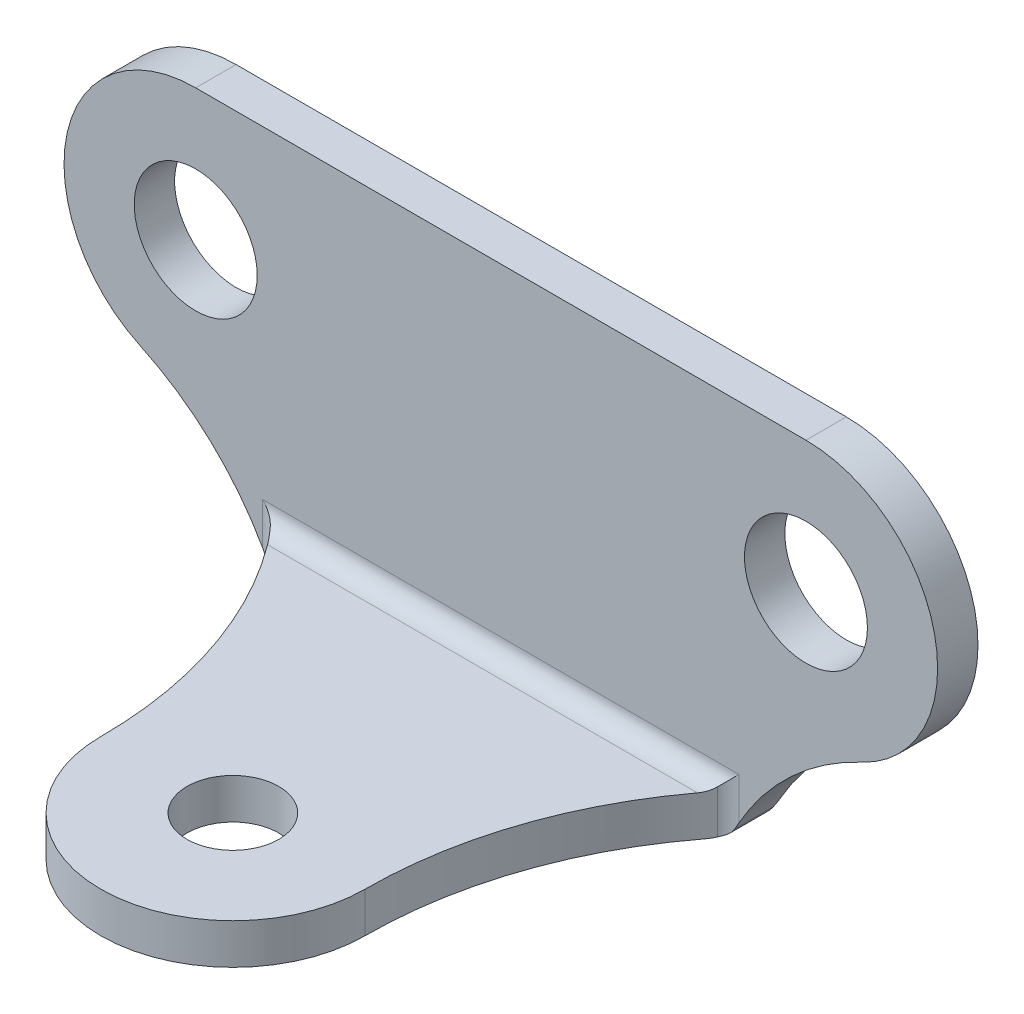
ISO-10303-21;
HEADER;
FILE_DESCRIPTION(('STEP AP214'),'2;1');
FILE_NAME('part.step','',(''),(''),'','','');
FILE_SCHEMA(('AUTOMOTIVE_DESIGN { 1 0 10303 214 1 1 1 1 }'));
ENDSEC;
DATA;
#1=APPLICATION_CONTEXT('core data for automotive mechanical design processes');
#2=APPLICATION_PROTOCOL_DEFINITION('international standard','automotive_design',2000,#1);
#3=PRODUCT_CONTEXT('',#1,'mechanical');
#4=PRODUCT('Part','Part','',(#3));
#5=PRODUCT_RELATED_PRODUCT_CATEGORY('part','',(#4));
#6=PRODUCT_DEFINITION_FORMATION('','',#4);
#7=PRODUCT_DEFINITION_CONTEXT('part definition',#1,'design');
#8=PRODUCT_DEFINITION('design','',#6,#7);
#9=PRODUCT_DEFINITION_SHAPE('','',#8);
#10=(LENGTH_UNIT() NAMED_UNIT(*) SI_UNIT(.MILLI.,.METRE.));
#11=(NAMED_UNIT(*) PLANE_ANGLE_UNIT() SI_UNIT($,.RADIAN.));
#12=(NAMED_UNIT(*) SI_UNIT($,.STERADIAN.) SOLID_ANGLE_UNIT());
#13=UNCERTAINTY_MEASURE_WITH_UNIT(LENGTH_MEASURE(1.E-05),#10,'distance_accuracy_value','');
#14=(GEOMETRIC_REPRESENTATION_CONTEXT(3) GLOBAL_UNCERTAINTY_ASSIGNED_CONTEXT((#13)) GLOBAL_UNIT_ASSIGNED_CONTEXT((#10,
#11,#12)) REPRESENTATION_CONTEXT('',''));
#15=CARTESIAN_POINT('',(0.,0.,0.));
#16=DIRECTION('',(0.,0.,1.));
#17=DIRECTION('',(1.,0.,0.));
#18=AXIS2_PLACEMENT_3D('',#15,#16,#17);
#19=CARTESIAN_POINT('',(0.,-13.625,2.2));
#20=DIRECTION('',(0.,1.,0.));
#21=DIRECTION('',(0.,0.,1.));
#22=AXIS2_PLACEMENT_3D('',#19,#20,#21);
#23=PLANE('',#22);
#24=DIRECTION('',(1.,0.,0.));
#25=VECTOR('',#24,1.);
#26=CARTESIAN_POINT('',(0.,-13.625,1.));
#27=LINE('',#26,#25);
#28=CARTESIAN_POINT('',(-11.8827784179782,-13.625,1.));
#29=VERTEX_POINT('',#28);
#30=CARTESIAN_POINT('',(11.8827784179782,-13.625,1.));
#31=VERTEX_POINT('',#30);
#32=EDGE_CURVE('E501',#29,#31,#27,.T.);
#33=ORIENTED_EDGE('',*,*,#32,.T.);
#34=DIRECTION('',(0.,0.,1.));
#35=VECTOR('',#34,1.);
#36=CARTESIAN_POINT('',(11.8827784179782,-13.625,2.2));
#37=LINE('',#36,#35);
#38=CARTESIAN_POINT('',(11.8827784179782,-13.625,2.97153809652351));
#39=VERTEX_POINT('',#38);
#40=EDGE_CURVE('E282',#31,#39,#37,.T.);
#41=ORIENTED_EDGE('',*,*,#40,.T.);
#42=CARTESIAN_POINT('',(29.9594339622642,-13.625,16.8));
#43=DIRECTION('',(0.,-1.,0.));
#44=DIRECTION('',(0.,0.,-1.));
#45=AXIS2_PLACEMENT_3D('',#42,#43,#44);
#46=CIRCLE('',#45,22.7594339622642);
#47=CARTESIAN_POINT('',(7.2,-13.625,16.8));
#48=VERTEX_POINT('',#47);
#49=EDGE_CURVE('E274',#48,#39,#46,.T.);
#50=ORIENTED_EDGE('',*,*,#49,.F.);
#51=CARTESIAN_POINT('',(0.,-13.625,16.8));
#52=DIRECTION('',(0.,1.,0.));
#53=DIRECTION('',(0.,0.,1.));
#54=AXIS2_PLACEMENT_3D('',#51,#52,#53);
#55=CIRCLE('',#54,7.2);
#56=CARTESIAN_POINT('',(-7.2,-13.625,16.8));
#57=VERTEX_POINT('',#56);
#58=EDGE_CURVE('E259',#57,#48,#55,.T.);
#59=ORIENTED_EDGE('',*,*,#58,.F.);
#60=CARTESIAN_POINT('',(-29.9594339622641,-13.625,16.8));
#61=DIRECTION('',(0.,1.,0.));
#62=DIRECTION('',(0.,0.,1.));
#63=AXIS2_PLACEMENT_3D('',#60,#61,#62);
#64=CIRCLE('',#63,22.7594339622642);
#65=CARTESIAN_POINT('',(-11.8827784179782,-13.625,2.97153809652352));
#66=VERTEX_POINT('',#65);
#67=EDGE_CURVE('E295',#57,#66,#64,.T.);
#68=ORIENTED_EDGE('',*,*,#67,.T.);
#69=DIRECTION('',(0.,0.,-1.));
#70=VECTOR('',#69,1.);
#71=CARTESIAN_POINT('',(-11.8827784179782,-13.625,2.2));
#72=LINE('',#71,#70);
#73=EDGE_CURVE('E500',#66,#29,#72,.T.);
#74=ORIENTED_EDGE('',*,*,#73,.T.);
#75=EDGE_LOOP('',(#33,#41,#50,#59,#68,#74));
#76=FACE_BOUND('',#75,.T.);
#77=CARTESIAN_POINT('',(0.,-13.625,16.8));
#78=DIRECTION('',(0.,1.,0.));
#79=DIRECTION('',(0.,0.,1.));
#80=AXIS2_PLACEMENT_3D('',#77,#78,#79);
#81=CIRCLE('',#80,2.5);
#82=CARTESIAN_POINT('',(0.,-13.625,19.3));
#83=VERTEX_POINT('',#82);
#84=EDGE_CURVE('E283',#83,#83,#81,.F.);
#85=ORIENTED_EDGE('',*,*,#84,.F.);
#86=EDGE_LOOP('',(#85));
#87=FACE_BOUND('',#86,.T.);
#88=ADVANCED_FACE('F142',(#76,#87),#23,.F.);
#89=CARTESIAN_POINT('',(0.,0.,2.2));
#90=DIRECTION('',(0.,0.,1.));
#91=DIRECTION('',(1.,0.,0.));
#92=AXIS2_PLACEMENT_3D('',#89,#90,#91);
#93=PLANE('',#92);
#94=DIRECTION('',(1.,0.,0.));
#95=VECTOR('',#94,1.);
#96=CARTESIAN_POINT('',(12.5,-10.425,2.2));
#97=LINE('',#96,#95);
#98=CARTESIAN_POINT('',(-12.9737645212873,-10.425,2.2));
#99=VERTEX_POINT('',#98);
#100=CARTESIAN_POINT('',(12.9737645212873,-10.425,2.2));
#101=VERTEX_POINT('',#100);
#102=EDGE_CURVE('E457',#99,#101,#97,.T.);
#103=ORIENTED_EDGE('',*,*,#102,.T.);
#104=DIRECTION('',(0.,-1.,0.));
#105=VECTOR('',#104,1.);
#106=CARTESIAN_POINT('',(12.9737645212873,0.,2.2));
#107=LINE('',#106,#105);
#108=CARTESIAN_POINT('',(12.9737645212873,-12.7124462090139,2.2));
#109=VERTEX_POINT('',#108);
#110=EDGE_CURVE('E510',#101,#109,#107,.T.);
#111=ORIENTED_EDGE('',*,*,#110,.T.);
#112=CARTESIAN_POINT('',(26.0418688277561,-20.0761850579445,2.2));
#113=DIRECTION('',(0.,0.,1.));
#114=DIRECTION('',(1.,0.,0.));
#115=AXIS2_PLACEMENT_3D('',#112,#113,#114);
#116=CIRCLE('',#115,15.);
#117=CARTESIAN_POINT('',(19.6719462836144,-6.495902042424,2.2));
#118=VERTEX_POINT('',#117);
#119=EDGE_CURVE('E300',#118,#109,#116,.T.);
#120=ORIENTED_EDGE('',*,*,#119,.F.);
#121=CARTESIAN_POINT('',(16.625,0.,2.2));
#122=DIRECTION('',(0.,0.,1.));
#123=DIRECTION('',(1.,0.,0.));
#124=AXIS2_PLACEMENT_3D('',#121,#122,#123);
#125=CIRCLE('',#124,7.17500000000001);
#126=CARTESIAN_POINT('',(16.625,7.175,2.2));
#127=VERTEX_POINT('',#126);
#128=EDGE_CURVE('E303',#118,#127,#125,.T.);
#129=ORIENTED_EDGE('',*,*,#128,.T.);
#130=DIRECTION('',(1.,0.,0.));
#131=VECTOR('',#130,1.);
#132=CARTESIAN_POINT('',(0.,7.175,2.2));
#133=LINE('',#132,#131);
#134=CARTESIAN_POINT('',(-16.625,7.175,2.2));
#135=VERTEX_POINT('',#134);
#136=EDGE_CURVE('E307',#135,#127,#133,.T.);
#137=ORIENTED_EDGE('',*,*,#136,.F.);
#138=CARTESIAN_POINT('',(-16.625,0.,2.2));
#139=DIRECTION('',(0.,0.,1.));
#140=DIRECTION('',(1.,0.,0.));
#141=AXIS2_PLACEMENT_3D('',#138,#139,#140);
#142=CIRCLE('',#141,7.17500000000001);
#143=CARTESIAN_POINT('',(-19.6719462836144,-6.49590204242399,2.2));
#144=VERTEX_POINT('',#143);
#145=EDGE_CURVE('E309',#144,#135,#142,.F.);
#146=ORIENTED_EDGE('',*,*,#145,.F.);
#147=CARTESIAN_POINT('',(-26.0418688277561,-20.0761850579445,2.2));
#148=DIRECTION('',(0.,0.,1.));
#149=DIRECTION('',(1.,0.,0.));
#150=AXIS2_PLACEMENT_3D('',#147,#148,#149);
#151=CIRCLE('',#150,15.);
#152=CARTESIAN_POINT('',(-12.9737645212873,-12.7124462090138,2.2));
#153=VERTEX_POINT('',#152);
#154=EDGE_CURVE('E312',#144,#153,#151,.F.);
#155=ORIENTED_EDGE('',*,*,#154,.T.);
#156=DIRECTION('',(0.,1.,0.));
#157=VECTOR('',#156,1.);
#158=CARTESIAN_POINT('',(-12.9737645212873,0.,2.2));
#159=LINE('',#158,#157);
#160=EDGE_CURVE('E513',#153,#99,#159,.T.);
#161=ORIENTED_EDGE('',*,*,#160,.T.);
#162=EDGE_LOOP('',(#103,#111,#120,#129,#137,#146,#155,#161));
#163=FACE_BOUND('',#162,.T.);
#164=CARTESIAN_POINT('',(-16.625,0.,2.2));
#165=DIRECTION('',(0.,0.,1.));
#166=DIRECTION('',(1.,0.,0.));
#167=AXIS2_PLACEMENT_3D('',#164,#165,#166);
#168=CIRCLE('',#167,3.35);
#169=CARTESIAN_POINT('',(-13.275,0.,2.2));
#170=VERTEX_POINT('',#169);
#171=EDGE_CURVE('E316',#170,#170,#168,.T.);
#172=ORIENTED_EDGE('',*,*,#171,.F.);
#173=EDGE_LOOP('',(#172));
#174=FACE_BOUND('',#173,.T.);
#175=CARTESIAN_POINT('',(16.625,0.,2.2));
#176=DIRECTION('',(0.,0.,1.));
#177=DIRECTION('',(1.,0.,0.));
#178=AXIS2_PLACEMENT_3D('',#175,#176,#177);
#179=CIRCLE('',#178,3.35);
#180=CARTESIAN_POINT('',(19.975,0.,2.2));
#181=VERTEX_POINT('',#180);
#182=EDGE_CURVE('E313',#181,#181,#179,.T.);
#183=ORIENTED_EDGE('',*,*,#182,.F.);
#184=EDGE_LOOP('',(#183));
#185=FACE_BOUND('',#184,.T.);
#186=ADVANCED_FACE('F516',(#163,#174,#185),#93,.T.);
#187=CARTESIAN_POINT('',(26.0418688277561,-20.0761850579445,2.2));
#188=DIRECTION('',(0.,0.,-1.));
#189=DIRECTION('',(-1.,0.,0.));
#190=AXIS2_PLACEMENT_3D('',#187,#188,#189);
#191=CYLINDRICAL_SURFACE('',#190,15.);
#192=ORIENTED_EDGE('',*,*,#119,.T.);
#193=CARTESIAN_POINT('',(12.9737645212873,-12.7124462090139,2.2));
#194=CARTESIAN_POINT('',(12.956107909083,-12.7437804076642,2.20000088545415));
#195=CARTESIAN_POINT('',(12.9385645711345,-12.7751775195939,2.20046761197653));
#196=CARTESIAN_POINT('',(12.9037263622448,-12.8380566546015,2.20230307221083));
#197=CARTESIAN_POINT('',(12.8864313381835,-12.8695386097622,2.20367122330454));
#198=CARTESIAN_POINT('',(12.8520889884275,-12.9325867732675,2.20727991941433));
#199=CARTESIAN_POINT('',(12.8350416606862,-12.9641529809134,2.20952045721813));
#200=CARTESIAN_POINT('',(12.8011923948623,-13.0273713505133,2.2148542162835));
#201=CARTESIAN_POINT('',(12.7843906224337,-13.0590235548237,2.21794798750109));
#202=CARTESIAN_POINT('',(12.7677215685894,-13.0906990661215,2.22145705171233));
#203=B_SPLINE_CURVE_WITH_KNOTS('',3,(#193,#194,#195,#196,#197,#198,#199,#200,#201,#202),
.UNSPECIFIED.,.F.,.F.,(4,2,2,2,4),(0.,0.107895058575143,0.215720449601137,0.323544949222262,
0.43143911076764),.UNSPECIFIED.);
#204=CARTESIAN_POINT('',(12.7677215685894,-13.0906990661215,2.22145705171234));
#205=VERTEX_POINT('',#204);
#206=EDGE_CURVE('E408',#109,#205,#203,.T.);
#207=ORIENTED_EDGE('',*,*,#206,.T.);
#208=DIRECTION('',(0.,0.,-1.));
#209=VECTOR('',#208,1.);
#210=CARTESIAN_POINT('',(12.7677215685894,-13.0906990661215,2.2));
#211=LINE('',#210,#209);
#212=CARTESIAN_POINT('',(12.7677215685894,-13.0906990661215,0.115056849388876));
#213=VERTEX_POINT('',#212);
#214=EDGE_CURVE('E361',#205,#213,#211,.T.);
#215=ORIENTED_EDGE('',*,*,#214,.T.);
#216=CARTESIAN_POINT('',(12.7677215685894,-13.0906990661215,0.115056849388876));
#217=CARTESIAN_POINT('',(12.7977235758196,-13.0336430256727,0.08499916810659));
#218=CARTESIAN_POINT('',(12.8293890752848,-12.9744055925245,0.0608974223090844));
#219=CARTESIAN_POINT('',(12.894460834239,-12.8546853768638,0.0247735720958849));
#220=CARTESIAN_POINT('',(12.9278266578283,-12.7942428500118,0.0125463717991968));
#221=CARTESIAN_POINT('',(12.971967853023,-12.715605609905,0.00394659767103593));
#222=CARTESIAN_POINT('',(12.982159535221,-12.6975381531105,0.00246965548645151));
#223=CARTESIAN_POINT('',(13.0026954350673,-12.6613089701068,0.000494465946542322));
#224=CARTESIAN_POINT('',(13.0130401757309,-12.6431472536829,1.46650087625419E-06));
#225=CARTESIAN_POINT('',(13.0234264772956,-12.625,0.));
#226=B_SPLINE_CURVE_WITH_KNOTS('',3,(#216,#217,#218,#219,#220,#221,#222,#223,#224,#225),
.UNSPECIFIED.,.F.,.F.,(4,2,2,2,4),(0.,0.213038588874756,0.422328458272732,0.484702229254517,
0.547407794334852),.UNSPECIFIED.);
#227=CARTESIAN_POINT('',(13.0234264772956,-12.625,0.));
#228=VERTEX_POINT('',#227);
#229=EDGE_CURVE('E351',#213,#228,#226,.T.);
#230=ORIENTED_EDGE('',*,*,#229,.T.);
#231=CARTESIAN_POINT('',(26.0418688277561,-20.0761850579445,0.));
#232=DIRECTION('',(0.,0.,1.));
#233=DIRECTION('',(1.,0.,0.));
#234=AXIS2_PLACEMENT_3D('',#231,#232,#233);
#235=CIRCLE('',#234,15.);
#236=CARTESIAN_POINT('',(19.6719462836144,-6.495902042424,0.));
#237=VERTEX_POINT('',#236);
#238=EDGE_CURVE('E297',#237,#228,#235,.T.);
#239=ORIENTED_EDGE('',*,*,#238,.F.);
#240=DIRECTION('',(0.,0.,-1.));
#241=VECTOR('',#240,1.);
#242=CARTESIAN_POINT('',(19.6719462836144,-6.495902042424,2.2));
#243=LINE('',#242,#241);
#244=EDGE_CURVE('E344',#118,#237,#243,.T.);
#245=ORIENTED_EDGE('',*,*,#244,.F.);
#246=EDGE_LOOP('',(#192,#207,#215,#230,#239,#245));
#247=FACE_BOUND('',#246,.T.);
#248=ADVANCED_FACE('F363',(#247),#191,.F.);
#249=CARTESIAN_POINT('',(16.625,0.,2.2));
#250=DIRECTION('',(0.,0.,-1.));
#251=DIRECTION('',(-1.,0.,0.));
#252=AXIS2_PLACEMENT_3D('',#249,#250,#251);
#253=CYLINDRICAL_SURFACE('',#252,7.17500000000001);
#254=CARTESIAN_POINT('',(16.625,0.,0.));
#255=DIRECTION('',(0.,0.,1.));
#256=DIRECTION('',(1.,0.,0.));
#257=AXIS2_PLACEMENT_3D('',#254,#255,#256);
#258=CIRCLE('',#257,7.17500000000001);
#259=CARTESIAN_POINT('',(16.625,7.175,0.));
#260=VERTEX_POINT('',#259);
#261=EDGE_CURVE('E322',#237,#260,#258,.T.);
#262=ORIENTED_EDGE('',*,*,#261,.T.);
#263=DIRECTION('',(0.,0.,-1.));
#264=VECTOR('',#263,1.);
#265=CARTESIAN_POINT('',(16.625,7.175,2.2));
#266=LINE('',#265,#264);
#267=EDGE_CURVE('E342',#127,#260,#266,.T.);
#268=ORIENTED_EDGE('',*,*,#267,.F.);
#269=ORIENTED_EDGE('',*,*,#128,.F.);
#270=ORIENTED_EDGE('',*,*,#244,.T.);
#271=EDGE_LOOP('',(#262,#268,#269,#270));
#272=FACE_BOUND('',#271,.T.);
#273=ADVANCED_FACE('F538',(#272),#253,.T.);
#274=CARTESIAN_POINT('',(0.,7.175,2.2));
#275=DIRECTION('',(0.,1.,0.));
#276=DIRECTION('',(0.,0.,1.));
#277=AXIS2_PLACEMENT_3D('',#274,#275,#276);
#278=PLANE('',#277);
#279=DIRECTION('',(1.,0.,0.));
#280=VECTOR('',#279,1.);
#281=CARTESIAN_POINT('',(0.,7.175,0.));
#282=LINE('',#281,#280);
#283=CARTESIAN_POINT('',(-16.625,7.175,0.));
#284=VERTEX_POINT('',#283);
#285=EDGE_CURVE('E325',#284,#260,#282,.T.);
#286=ORIENTED_EDGE('',*,*,#285,.F.);
#287=DIRECTION('',(0.,0.,-1.));
#288=VECTOR('',#287,1.);
#289=CARTESIAN_POINT('',(-16.625,7.175,2.2));
#290=LINE('',#289,#288);
#291=EDGE_CURVE('E340',#135,#284,#290,.T.);
#292=ORIENTED_EDGE('',*,*,#291,.F.);
#293=ORIENTED_EDGE('',*,*,#136,.T.);
#294=ORIENTED_EDGE('',*,*,#267,.T.);
#295=EDGE_LOOP('',(#286,#292,#293,#294));
#296=FACE_BOUND('',#295,.T.);
#297=ADVANCED_FACE('F661',(#296),#278,.T.);
#298=CARTESIAN_POINT('',(-16.625,0.,2.2));
#299=DIRECTION('',(0.,0.,-1.));
#300=DIRECTION('',(-1.,0.,0.));
#301=AXIS2_PLACEMENT_3D('',#298,#299,#300);
#302=CYLINDRICAL_SURFACE('',#301,7.17500000000001);
#303=CARTESIAN_POINT('',(-16.625,0.,0.));
#304=DIRECTION('',(0.,0.,1.));
#305=DIRECTION('',(1.,0.,0.));
#306=AXIS2_PLACEMENT_3D('',#303,#304,#305);
#307=CIRCLE('',#306,7.17500000000001);
#308=CARTESIAN_POINT('',(-19.6719462836144,-6.49590204242399,0.));
#309=VERTEX_POINT('',#308);
#310=EDGE_CURVE('E328',#309,#284,#307,.F.);
#311=ORIENTED_EDGE('',*,*,#310,.F.);
#312=DIRECTION('',(0.,0.,-1.));
#313=VECTOR('',#312,1.);
#314=CARTESIAN_POINT('',(-19.6719462836144,-6.49590204242399,2.2));
#315=LINE('',#314,#313);
#316=EDGE_CURVE('E319',#144,#309,#315,.T.);
#317=ORIENTED_EDGE('',*,*,#316,.F.);
#318=ORIENTED_EDGE('',*,*,#145,.T.);
#319=ORIENTED_EDGE('',*,*,#291,.T.);
#320=EDGE_LOOP('',(#311,#317,#318,#319));
#321=FACE_BOUND('',#320,.T.);
#322=ADVANCED_FACE('F396',(#321),#302,.T.);
#323=CARTESIAN_POINT('',(-26.0418688277561,-20.0761850579445,2.2));
#324=DIRECTION('',(0.,0.,-1.));
#325=DIRECTION('',(-1.,0.,0.));
#326=AXIS2_PLACEMENT_3D('',#323,#324,#325);
#327=CYLINDRICAL_SURFACE('',#326,15.);
#328=CARTESIAN_POINT('',(-26.0418688277561,-20.0761850579445,0.));
#329=DIRECTION('',(0.,0.,1.));
#330=DIRECTION('',(1.,0.,0.));
#331=AXIS2_PLACEMENT_3D('',#328,#329,#330);
#332=CIRCLE('',#331,15.);
#333=CARTESIAN_POINT('',(-13.0234264772956,-12.625,0.));
#334=VERTEX_POINT('',#333);
#335=EDGE_CURVE('E331',#309,#334,#332,.F.);
#336=ORIENTED_EDGE('',*,*,#335,.T.);
#337=CARTESIAN_POINT('',(-13.0234264772956,-12.625,0.));
#338=CARTESIAN_POINT('',(-12.9881264043402,-12.68663073137,-4.58488800088248E-05));
#339=CARTESIAN_POINT('',(-12.953217255623,-12.7486819497931,0.00569943032613455));
#340=CARTESIAN_POINT('',(-12.8858202009725,-12.8704256479382,0.0286551985945072));
#341=CARTESIAN_POINT('',(-12.8532995600371,-12.9301405205885,0.0456527520939202));
#342=CARTESIAN_POINT('',(-12.8128303488217,-13.0056164918615,0.0750790869950173));
#343=CARTESIAN_POINT('',(-12.8036569889009,-13.0228082451825,0.0823400548575693));
#344=CARTESIAN_POINT('',(-12.7855159323488,-13.0569629814619,0.0979127888938496));
#345=CARTESIAN_POINT('',(-12.7765496651828,-13.0739241577277,0.106230180594827));
#346=CARTESIAN_POINT('',(-12.7677215685894,-13.0906990661215,0.115056849388849));
#347=B_SPLINE_CURVE_WITH_KNOTS('',3,(#337,#338,#339,#340,#341,#342,#343,#344,#345,#346),
.UNSPECIFIED.,.F.,.F.,(4,2,2,2,4),(0.,0.213142602863398,0.422362823639429,0.484725313689105,
0.547435024665581),.UNSPECIFIED.);
#348=CARTESIAN_POINT('',(-12.7677215685894,-13.0906990661215,0.115056849388876));
#349=VERTEX_POINT('',#348);
#350=EDGE_CURVE('E380',#334,#349,#347,.T.);
#351=ORIENTED_EDGE('',*,*,#350,.T.);
#352=DIRECTION('',(0.,0.,-1.));
#353=VECTOR('',#352,1.);
#354=CARTESIAN_POINT('',(-12.7677215685894,-13.0906990661215,2.2));
#355=LINE('',#354,#353);
#356=CARTESIAN_POINT('',(-12.7677215685894,-13.0906990661215,2.22145705171234));
#357=VERTEX_POINT('',#356);
#358=EDGE_CURVE('E167',#349,#357,#355,.F.);
#359=ORIENTED_EDGE('',*,*,#358,.T.);
#360=CARTESIAN_POINT('',(-12.7677215685894,-13.0906990661215,2.22145705171234));
#361=CARTESIAN_POINT('',(-12.7843906224337,-13.0590235548237,2.21794798750109));
#362=CARTESIAN_POINT('',(-12.8011923948623,-13.0273713505133,2.2148542162835));
#363=CARTESIAN_POINT('',(-12.8350416606862,-12.9641529809134,2.20952045721813));
#364=CARTESIAN_POINT('',(-12.8520889884275,-12.9325867732675,2.20727991941433));
#365=CARTESIAN_POINT('',(-12.8864313381835,-12.8695386097622,2.20367122330454));
#366=CARTESIAN_POINT('',(-12.9037263622448,-12.8380566546015,2.20230307221083));
#367=CARTESIAN_POINT('',(-12.9385645711345,-12.7751775195939,2.20046761197653));
#368=CARTESIAN_POINT('',(-12.956107909083,-12.7437804076642,2.20000088545415));
#369=CARTESIAN_POINT('',(-12.9737645212873,-12.7124462090138,2.2));
#370=B_SPLINE_CURVE_WITH_KNOTS('',3,(#360,#361,#362,#363,#364,#365,#366,#367,#368,#369),
.UNSPECIFIED.,.F.,.F.,(4,2,2,2,4),(0.,0.107894161545381,0.215718661166508,0.323544052192503,
0.431439110767644),.UNSPECIFIED.);
#371=EDGE_CURVE('E401',#357,#153,#370,.T.);
#372=ORIENTED_EDGE('',*,*,#371,.T.);
#373=ORIENTED_EDGE('',*,*,#154,.F.);
#374=ORIENTED_EDGE('',*,*,#316,.T.);
#375=EDGE_LOOP('',(#336,#351,#359,#372,#373,#374));
#376=FACE_BOUND('',#375,.T.);
#377=ADVANCED_FACE('F390',(#376),#327,.F.);
#378=CARTESIAN_POINT('',(16.625,0.,2.2));
#379=DIRECTION('',(0.,0.,-1.));
#380=DIRECTION('',(-1.,0.,0.));
#381=AXIS2_PLACEMENT_3D('',#378,#379,#380);
#382=CYLINDRICAL_SURFACE('',#381,3.35);
#383=ORIENTED_EDGE('',*,*,#182,.T.);
#384=EDGE_LOOP('',(#383));
#385=FACE_BOUND('',#384,.T.);
#386=CARTESIAN_POINT('',(16.625,0.,0.));
#387=DIRECTION('',(0.,0.,1.));
#388=DIRECTION('',(1.,0.,0.));
#389=AXIS2_PLACEMENT_3D('',#386,#387,#388);
#390=CIRCLE('',#389,3.35);
#391=CARTESIAN_POINT('',(19.975,0.,0.));
#392=VERTEX_POINT('',#391);
#393=EDGE_CURVE('E334',#392,#392,#390,.T.);
#394=ORIENTED_EDGE('',*,*,#393,.F.);
#395=EDGE_LOOP('',(#394));
#396=FACE_BOUND('',#395,.T.);
#397=ADVANCED_FACE('F395',(#385,#396),#382,.F.);
#398=CARTESIAN_POINT('',(-16.625,0.,2.2));
#399=DIRECTION('',(0.,0.,-1.));
#400=DIRECTION('',(-1.,0.,0.));
#401=AXIS2_PLACEMENT_3D('',#398,#399,#400);
#402=CYLINDRICAL_SURFACE('',#401,3.35);
#403=ORIENTED_EDGE('',*,*,#171,.T.);
#404=EDGE_LOOP('',(#403));
#405=FACE_BOUND('',#404,.T.);
#406=CARTESIAN_POINT('',(-16.625,0.,0.));
#407=DIRECTION('',(0.,0.,1.));
#408=DIRECTION('',(1.,0.,0.));
#409=AXIS2_PLACEMENT_3D('',#406,#407,#408);
#410=CIRCLE('',#409,3.35);
#411=CARTESIAN_POINT('',(-13.275,0.,0.));
#412=VERTEX_POINT('',#411);
#413=EDGE_CURVE('E304',#412,#412,#410,.T.);
#414=ORIENTED_EDGE('',*,*,#413,.F.);
#415=EDGE_LOOP('',(#414));
#416=FACE_BOUND('',#415,.T.);
#417=ADVANCED_FACE('F528',(#405,#416),#402,.F.);
#418=CARTESIAN_POINT('',(0.,0.,0.));
#419=DIRECTION('',(0.,0.,1.));
#420=DIRECTION('',(1.,0.,0.));
#421=AXIS2_PLACEMENT_3D('',#418,#419,#420);
#422=PLANE('',#421);
#423=ORIENTED_EDGE('',*,*,#238,.T.);
#424=DIRECTION('',(1.,0.,0.));
#425=VECTOR('',#424,1.);
#426=CARTESIAN_POINT('',(0.,-12.625,0.));
#427=LINE('',#426,#425);
#428=EDGE_CURVE('E512',#228,#334,#427,.F.);
#429=ORIENTED_EDGE('',*,*,#428,.T.);
#430=ORIENTED_EDGE('',*,*,#335,.F.);
#431=ORIENTED_EDGE('',*,*,#310,.T.);
#432=ORIENTED_EDGE('',*,*,#285,.T.);
#433=ORIENTED_EDGE('',*,*,#261,.F.);
#434=EDGE_LOOP('',(#423,#429,#430,#431,#432,#433));
#435=FACE_BOUND('',#434,.T.);
#436=ORIENTED_EDGE('',*,*,#393,.T.);
#437=EDGE_LOOP('',(#436));
#438=FACE_BOUND('',#437,.T.);
#439=ORIENTED_EDGE('',*,*,#413,.T.);
#440=EDGE_LOOP('',(#439));
#441=FACE_BOUND('',#440,.T.);
#442=ADVANCED_FACE('F523',(#435,#438,#441),#422,.F.);
#443=CARTESIAN_POINT('',(0.,-11.425,24.));
#444=DIRECTION('',(0.,1.,0.));
#445=DIRECTION('',(0.,0.,1.));
#446=AXIS2_PLACEMENT_3D('',#443,#444,#445);
#447=PLANE('',#446);
#448=CARTESIAN_POINT('',(0.,-11.425,16.8));
#449=DIRECTION('',(0.,1.,0.));
#450=DIRECTION('',(0.,0.,1.));
#451=AXIS2_PLACEMENT_3D('',#448,#449,#450);
#452=CIRCLE('',#451,2.5);
#453=CARTESIAN_POINT('',(0.,-11.425,19.3));
#454=VERTEX_POINT('',#453);
#455=EDGE_CURVE('E286',#454,#454,#452,.F.);
#456=ORIENTED_EDGE('',*,*,#455,.T.);
#457=EDGE_LOOP('',(#456));
#458=FACE_BOUND('',#457,.T.);
#459=CARTESIAN_POINT('',(29.9594339622642,-11.425,16.8));
#460=DIRECTION('',(0.,1.,0.));
#461=DIRECTION('',(0.,0.,1.));
#462=AXIS2_PLACEMENT_3D('',#459,#460,#461);
#463=CIRCLE('',#462,22.7594339622642);
#464=CARTESIAN_POINT('',(11.7102741382431,-11.425,3.20000000000001));
#465=VERTEX_POINT('',#464);
#466=CARTESIAN_POINT('',(7.2,-11.425,16.8));
#467=VERTEX_POINT('',#466);
#468=EDGE_CURVE('E276',#465,#467,#463,.T.);
#469=ORIENTED_EDGE('',*,*,#468,.F.);
#470=DIRECTION('',(1.,0.,0.));
#471=VECTOR('',#470,1.);
#472=CARTESIAN_POINT('',(-12.5,-11.425,3.2));
#473=LINE('',#472,#471);
#474=CARTESIAN_POINT('',(-11.7102741382448,-11.425,3.19999999999773));
#475=VERTEX_POINT('',#474);
#476=EDGE_CURVE('E485',#465,#475,#473,.F.);
#477=ORIENTED_EDGE('',*,*,#476,.T.);
#478=CARTESIAN_POINT('',(-29.9594339622641,-11.425,16.8));
#479=DIRECTION('',(0.,1.,0.));
#480=DIRECTION('',(0.,0.,1.));
#481=AXIS2_PLACEMENT_3D('',#478,#479,#480);
#482=CIRCLE('',#481,22.7594339622642);
#483=CARTESIAN_POINT('',(-7.2,-11.425,16.8));
#484=VERTEX_POINT('',#483);
#485=EDGE_CURVE('E268',#484,#475,#482,.T.);
#486=ORIENTED_EDGE('',*,*,#485,.F.);
#487=CARTESIAN_POINT('',(0.,-11.425,16.8));
#488=DIRECTION('',(0.,1.,0.));
#489=DIRECTION('',(0.,0.,1.));
#490=AXIS2_PLACEMENT_3D('',#487,#488,#489);
#491=CIRCLE('',#490,7.2);
#492=EDGE_CURVE('E269',#484,#467,#491,.T.);
#493=ORIENTED_EDGE('',*,*,#492,.T.);
#494=EDGE_LOOP('',(#469,#477,#486,#493));
#495=FACE_BOUND('',#494,.T.);
#496=ADVANCED_FACE('F472',(#458,#495),#447,.T.);
#497=CARTESIAN_POINT('',(-29.9594339622641,-13.625012,16.8));
#498=DIRECTION('',(0.,1.,0.));
#499=DIRECTION('',(0.,0.,1.));
#500=AXIS2_PLACEMENT_3D('',#497,#498,#499);
#501=CYLINDRICAL_SURFACE('',#500,22.7594339622642);
#502=DIRECTION('',(0.,1.,0.));
#503=VECTOR('',#502,1.);
#504=CARTESIAN_POINT('',(-12.1931527889034,-13.625012,2.57498374159982));
#505=LINE('',#504,#503);
#506=CARTESIAN_POINT('',(-12.1931527889034,-11.2056117323839,2.57498374159982));
#507=VERTEX_POINT('',#506);
#508=CARTESIAN_POINT('',(-12.1931527889034,-13.5756144065145,2.57498374159982));
#509=VERTEX_POINT('',#508);
#510=EDGE_CURVE('E160',#507,#509,#505,.F.);
#511=ORIENTED_EDGE('',*,*,#510,.T.);
#512=CARTESIAN_POINT('',(-12.1931527889034,-13.5756144065145,2.57498374159982));
#513=CARTESIAN_POINT('',(-12.167249773052,-13.5840673538341,2.60733446039926));
#514=CARTESIAN_POINT('',(-12.1412940146217,-13.5913749481045,2.63993366280057));
#515=CARTESIAN_POINT('',(-12.0894261332481,-13.6037787962088,2.70544821124671));
#516=CARTESIAN_POINT('',(-12.0635140666053,-13.6088806117727,2.73836254572607));
#517=CARTESIAN_POINT('',(-12.0117518414853,-13.6169939517186,2.80448985125101));
#518=CARTESIAN_POINT('',(-11.9859016797497,-13.6200055886427,2.83770280612034));
#519=CARTESIAN_POINT('',(-11.9342615744821,-13.6240096700499,2.90443296807234));
#520=CARTESIAN_POINT('',(-11.9084719511006,-13.6249969618808,2.93795073397678));
#521=CARTESIAN_POINT('',(-11.8827784179784,-13.6250000000014,2.97153809652329));
#522=B_SPLINE_CURVE_WITH_KNOTS('',3,(#512,#513,#514,#515,#516,#517,#518,#519,#520,#521),
.UNSPECIFIED.,.F.,.F.,(4,2,2,2,4),(0.,0.126863520999168,0.253405271296953,0.37994020764422,
0.506796820966919),.UNSPECIFIED.);
#523=EDGE_CURVE('E476',#509,#66,#522,.T.);
#524=ORIENTED_EDGE('',*,*,#523,.T.);
#525=ORIENTED_EDGE('',*,*,#67,.F.);
#526=DIRECTION('',(0.,1.,0.));
#527=VECTOR('',#526,1.);
#528=CARTESIAN_POINT('',(-7.2,-13.625012,16.8));
#529=LINE('',#528,#527);
#530=EDGE_CURVE('E264',#57,#484,#529,.T.);
#531=ORIENTED_EDGE('',*,*,#530,.T.);
#532=ORIENTED_EDGE('',*,*,#485,.T.);
#533=CARTESIAN_POINT('',(-11.7102741382479,-11.425,3.2));
#534=CARTESIAN_POINT('',(-11.7615132664111,-11.4249608937851,3.13121219793042));
#535=CARTESIAN_POINT('',(-11.8132337464994,-11.4178983211985,3.06265471120719));
#536=CARTESIAN_POINT('',(-11.9148070020378,-11.3900826453237,2.92953154183018));
#537=CARTESIAN_POINT('',(-11.9646752916011,-11.3696503978204,2.86491018254377));
#538=CARTESIAN_POINT('',(-12.0443887195993,-11.3253567581851,2.76270843678687));
#539=CARTESIAN_POINT('',(-12.0748842845447,-11.3054851008732,2.72388487923942));
#540=CARTESIAN_POINT('',(-12.1349675520938,-11.2599517771517,2.64787557144616));
#541=CARTESIAN_POINT('',(-12.1645347708293,-11.2342077191026,2.61072313042329));
#542=CARTESIAN_POINT('',(-12.1931527889034,-11.2056117323839,2.57498374159982));
#543=B_SPLINE_CURVE_WITH_KNOTS('',3,(#533,#534,#535,#536,#537,#538,#539,#540,#541,#542),
.UNSPECIFIED.,.F.,.F.,(4,2,2,2,4),(0.,0.257227761683945,0.508498223247389,0.667835875517412,
0.829563979911418),.UNSPECIFIED.);
#544=EDGE_CURVE('E12',#475,#507,#543,.T.);
#545=ORIENTED_EDGE('',*,*,#544,.T.);
#546=EDGE_LOOP('',(#511,#524,#525,#531,#532,#545));
#547=FACE_BOUND('',#546,.T.);
#548=ADVANCED_FACE('F468',(#547),#501,.F.);
#549=CARTESIAN_POINT('',(0.,-13.625012,16.8));
#550=DIRECTION('',(0.,1.,0.));
#551=DIRECTION('',(0.,0.,1.));
#552=AXIS2_PLACEMENT_3D('',#549,#550,#551);
#553=CYLINDRICAL_SURFACE('',#552,7.2);
#554=ORIENTED_EDGE('',*,*,#58,.T.);
#555=DIRECTION('',(0.,-1.,0.));
#556=VECTOR('',#555,1.);
#557=CARTESIAN_POINT('',(7.2,10.375,16.8));
#558=LINE('',#557,#556);
#559=EDGE_CURVE('E262',#467,#48,#558,.T.);
#560=ORIENTED_EDGE('',*,*,#559,.F.);
#561=ORIENTED_EDGE('',*,*,#492,.F.);
#562=ORIENTED_EDGE('',*,*,#530,.F.);
#563=EDGE_LOOP('',(#554,#560,#561,#562));
#564=FACE_BOUND('',#563,.T.);
#565=ADVANCED_FACE('F261',(#564),#553,.T.);
#566=CARTESIAN_POINT('',(29.9594339622642,10.375,16.8));
#567=DIRECTION('',(0.,-1.,0.));
#568=DIRECTION('',(0.,0.,-1.));
#569=AXIS2_PLACEMENT_3D('',#566,#567,#568);
#570=CYLINDRICAL_SURFACE('',#569,22.7594339622642);
#571=ORIENTED_EDGE('',*,*,#49,.T.);
#572=CARTESIAN_POINT('',(11.8827784179782,-13.625,2.97153809652351));
#573=CARTESIAN_POINT('',(11.9084719511004,-13.6249969618803,2.93795073397696));
#574=CARTESIAN_POINT('',(11.934261574482,-13.6240096700498,2.90443296807248));
#575=CARTESIAN_POINT('',(11.9859016797496,-13.6200055886428,2.83770280612043));
#576=CARTESIAN_POINT('',(12.0117518414853,-13.6169939517186,2.80448985125108));
#577=CARTESIAN_POINT('',(12.0635140666052,-13.6088806117726,2.73836254572612));
#578=CARTESIAN_POINT('',(12.089426133248,-13.6037787962088,2.70544821124676));
#579=CARTESIAN_POINT('',(12.1412940146217,-13.5913749481046,2.6399336628006));
#580=CARTESIAN_POINT('',(12.167249773052,-13.5840673538342,2.60733446039927));
#581=CARTESIAN_POINT('',(12.1931527889034,-13.5756144065145,2.57498374159982));
#582=B_SPLINE_CURVE_WITH_KNOTS('',3,(#572,#573,#574,#575,#576,#577,#578,#579,#580,#581),
.UNSPECIFIED.,.F.,.F.,(4,2,2,2,4),(0.,0.126856613322801,0.253391549670136,0.379933299967937,
0.506796820967155),.UNSPECIFIED.);
#583=CARTESIAN_POINT('',(12.1931527889034,-13.5756144065145,2.57498374159982));
#584=VERTEX_POINT('',#583);
#585=EDGE_CURVE('E450',#39,#584,#582,.T.);
#586=ORIENTED_EDGE('',*,*,#585,.T.);
#587=DIRECTION('',(0.,-1.,0.));
#588=VECTOR('',#587,1.);
#589=CARTESIAN_POINT('',(12.1931527889034,10.375,2.57498374159982));
#590=LINE('',#589,#588);
#591=CARTESIAN_POINT('',(12.1931527889034,-11.2056117323839,2.57498374159983));
#592=VERTEX_POINT('',#591);
#593=EDGE_CURVE('E458',#584,#592,#590,.F.);
#594=ORIENTED_EDGE('',*,*,#593,.T.);
#595=CARTESIAN_POINT('',(12.1931527889034,-11.2056117323839,2.57498374159983));
#596=CARTESIAN_POINT('',(12.1702910843583,-11.2284603871548,2.60353565097077));
#597=CARTESIAN_POINT('',(12.1468221590894,-11.2494858749121,2.63298950621138));
#598=CARTESIAN_POINT('',(12.0989362126263,-11.2879316514743,2.69340810621665));
#599=CARTESIAN_POINT('',(12.0745197620398,-11.3053540712601,2.72437194445415));
#600=CARTESIAN_POINT('',(12.0013674189968,-11.3515818879638,2.81766121163484));
#601=CARTESIAN_POINT('',(11.9516330598994,-11.3754093907218,2.88174921271703));
#602=CARTESIAN_POINT('',(11.8699730199593,-11.4032351021571,2.98819590044311));
#603=CARTESIAN_POINT('',(11.8383082064558,-11.411312818779,3.02976473556955));
#604=CARTESIAN_POINT('',(11.7744762657643,-11.422226840178,3.11416776513819));
#605=CARTESIAN_POINT('',(11.7423085198716,-11.4249853499552,3.1570115684816));
#606=CARTESIAN_POINT('',(11.7102741382431,-11.425,3.2));
#607=B_SPLINE_CURVE_WITH_KNOTS('',3,(#595,#596,#597,#598,#599,#600,#601,#602,#603,#604,#605,
#606),.UNSPECIFIED.,.F.,.F.,(4,2,2,2,2,4),(0.,0.129247094428561,0.258417527583685,
0.510703202151468,0.669095825732596,0.829787924679907),.UNSPECIFIED.);
#608=EDGE_CURVE('E152',#592,#465,#607,.T.);
#609=ORIENTED_EDGE('',*,*,#608,.T.);
#610=ORIENTED_EDGE('',*,*,#468,.T.);
#611=ORIENTED_EDGE('',*,*,#559,.T.);
#612=EDGE_LOOP('',(#571,#586,#594,#609,#610,#611));
#613=FACE_BOUND('',#612,.T.);
#614=ADVANCED_FACE('F273',(#613),#570,.F.);
#615=CARTESIAN_POINT('',(0.,-13.625012,16.8));
#616=DIRECTION('',(0.,1.,0.));
#617=DIRECTION('',(0.,0.,1.));
#618=AXIS2_PLACEMENT_3D('',#615,#616,#617);
#619=CYLINDRICAL_SURFACE('',#618,2.5);
#620=CARTESIAN_POINT('',(0.,-11.425,19.3));
#621=CARTESIAN_POINT('',(0.,-11.4479166666667,19.3));
#622=CARTESIAN_POINT('',(0.,-11.4708333333333,19.3));
#623=CARTESIAN_POINT('',(0.,-11.5166666666667,19.3));
#624=CARTESIAN_POINT('',(0.,-11.5395833333333,19.3));
#625=CARTESIAN_POINT('',(0.,-11.5854166666667,19.3));
#626=CARTESIAN_POINT('',(0.,-11.6083333333333,19.3));
#627=CARTESIAN_POINT('',(0.,-11.6541666666667,19.3));
#628=CARTESIAN_POINT('',(0.,-11.6770833333333,19.3));
#629=CARTESIAN_POINT('',(0.,-11.7229166666667,19.3));
#630=CARTESIAN_POINT('',(0.,-11.7458333333333,19.3));
#631=CARTESIAN_POINT('',(0.,-11.7916666666667,19.3));
#632=CARTESIAN_POINT('',(0.,-11.8145833333333,19.3));
#633=CARTESIAN_POINT('',(0.,-11.8604166666667,19.3));
#634=CARTESIAN_POINT('',(0.,-11.8833333333333,19.3));
#635=CARTESIAN_POINT('',(0.,-11.9291666666667,19.3));
#636=CARTESIAN_POINT('',(0.,-11.9520833333333,19.3));
#637=CARTESIAN_POINT('',(0.,-11.9979166666667,19.3));
#638=CARTESIAN_POINT('',(0.,-12.0208333333333,19.3));
#639=CARTESIAN_POINT('',(0.,-12.0666666666667,19.3));
#640=CARTESIAN_POINT('',(0.,-12.0895833333333,19.3));
#641=CARTESIAN_POINT('',(0.,-12.1354166666667,19.3));
#642=CARTESIAN_POINT('',(0.,-12.1583333333333,19.3));
#643=CARTESIAN_POINT('',(0.,-12.2041666666667,19.3));
#644=CARTESIAN_POINT('',(0.,-12.2270833333333,19.3));
#645=CARTESIAN_POINT('',(0.,-12.2729166666667,19.3));
#646=CARTESIAN_POINT('',(0.,-12.2958333333333,19.3));
#647=CARTESIAN_POINT('',(0.,-12.3416666666667,19.3));
#648=CARTESIAN_POINT('',(0.,-12.3645833333333,19.3));
#649=CARTESIAN_POINT('',(0.,-12.4104166666667,19.3));
#650=CARTESIAN_POINT('',(0.,-12.4333333333333,19.3));
#651=CARTESIAN_POINT('',(0.,-12.4791666666667,19.3));
#652=CARTESIAN_POINT('',(0.,-12.5020833333333,19.3));
#653=CARTESIAN_POINT('',(0.,-12.5479166666667,19.3));
#654=CARTESIAN_POINT('',(0.,-12.5708333333333,19.3));
#655=CARTESIAN_POINT('',(0.,-12.6166666666667,19.3));
#656=CARTESIAN_POINT('',(0.,-12.6395833333333,19.3));
#657=CARTESIAN_POINT('',(0.,-12.6854166666667,19.3));
#658=CARTESIAN_POINT('',(0.,-12.7083333333333,19.3));
#659=CARTESIAN_POINT('',(0.,-12.7541666666667,19.3));
#660=CARTESIAN_POINT('',(0.,-12.7770833333333,19.3));
#661=CARTESIAN_POINT('',(0.,-12.8229166666667,19.3));
#662=CARTESIAN_POINT('',(0.,-12.8458333333333,19.3));
#663=CARTESIAN_POINT('',(0.,-12.8916666666667,19.3));
#664=CARTESIAN_POINT('',(0.,-12.9145833333333,19.3));
#665=CARTESIAN_POINT('',(0.,-12.9604166666667,19.3));
#666=CARTESIAN_POINT('',(0.,-12.9833333333333,19.3));
#667=CARTESIAN_POINT('',(0.,-13.0291666666667,19.3));
#668=CARTESIAN_POINT('',(0.,-13.0520833333333,19.3));
#669=CARTESIAN_POINT('',(0.,-13.0979166666667,19.3));
#670=CARTESIAN_POINT('',(0.,-13.1208333333333,19.3));
#671=CARTESIAN_POINT('',(0.,-13.1666666666667,19.3));
#672=CARTESIAN_POINT('',(0.,-13.1895833333333,19.3));
#673=CARTESIAN_POINT('',(0.,-13.2354166666667,19.3));
#674=CARTESIAN_POINT('',(0.,-13.2583333333333,19.3));
#675=CARTESIAN_POINT('',(0.,-13.3041666666667,19.3));
#676=CARTESIAN_POINT('',(0.,-13.3270833333333,19.3));
#677=CARTESIAN_POINT('',(0.,-13.3729166666667,19.3));
#678=CARTESIAN_POINT('',(0.,-13.3958333333333,19.3));
#679=CARTESIAN_POINT('',(0.,-13.4416666666667,19.3));
#680=CARTESIAN_POINT('',(0.,-13.4645833333333,19.3));
#681=CARTESIAN_POINT('',(0.,-13.5104166666667,19.3));
#682=CARTESIAN_POINT('',(0.,-13.5333333333333,19.3));
#683=CARTESIAN_POINT('',(0.,-13.5791666666667,19.3));
#684=CARTESIAN_POINT('',(0.,-13.6020833333333,19.3));
#685=CARTESIAN_POINT('',(0.,-13.625,19.3));
#686=B_SPLINE_CURVE_WITH_KNOTS('',3,(#620,#621,#622,#623,#624,#625,#626,#627,#628,#629,#630,
#631,#632,#633,#634,#635,#636,#637,#638,#639,#640,#641,#642,#643,#644,#645,#646,#647,#648,#649,
#650,#651,#652,#653,#654,#655,#656,#657,#658,#659,#660,#661,#662,#663,#664,#665,#666,#667,#668,
#669,#670,#671,#672,#673,#674,#675,#676,#677,#678,#679,#680,#681,#682,#683,#684,#685),
.UNSPECIFIED.,.F.,.F.,(4,2,2,2,2,2,2,2,2,2,2,2,2,2,2,2,2,2,2,2,2,2,2,2,2,2,2,2,2,2,2,2,4),(0.,
0.0687499999999994,0.1375,0.20625,0.274999999999999,0.343749999999999,0.4125,0.481249999999999,
0.55,0.618749999999999,0.687499999999999,0.75625,0.824999999999999,0.89375,0.9625,1.03125,1.1,
1.16875,1.2375,1.30625,1.375,1.44375,1.5125,1.58125,1.65,1.71875,1.7875,1.85625,1.925,1.99375,
2.0625,2.13125,2.2),.UNSPECIFIED.);
#687=EDGE_CURVE('BSEAM422',#454,#83,#686,.T.);
#688=ORIENTED_EDGE('',*,*,#455,.F.);
#689=ORIENTED_EDGE('',*,*,#84,.T.);
#690=ORIENTED_EDGE('',*,*,#687,.T.);
#691=ORIENTED_EDGE('',*,*,#687,.F.);
#692=EDGE_LOOP('',(#688,#690,#689,#691));
#693=FACE_BOUND('',#692,.T.);
#694=ADVANCED_FACE('F422',(#693),#619,.F.);
#695=CARTESIAN_POINT('',(-12.9737645212873,-13.625012,3.2));
#696=DIRECTION('',(0.,1.,0.));
#697=DIRECTION('',(0.,0.,1.));
#698=AXIS2_PLACEMENT_3D('',#695,#696,#697);
#699=CYLINDRICAL_SURFACE('',#698,1.);
#700=ORIENTED_EDGE('',*,*,#510,.F.);
#701=CARTESIAN_POINT('',(-12.9737645212873,-10.425,3.2));
#702=DIRECTION('',(-0.707106781186548,-0.707106781186547,0.));
#703=DIRECTION('',(-0.707106781186548,0.707106781186547,0.));
#704=AXIS2_PLACEMENT_3D('',#701,#702,#703);
#705=ELLIPSE('',#704,1.41421356237309,1.);
#706=EDGE_CURVE('E147',#99,#507,#705,.T.);
#707=ORIENTED_EDGE('',*,*,#706,.F.);
#708=ORIENTED_EDGE('',*,*,#160,.F.);
#709=ORIENTED_EDGE('',*,*,#371,.F.);
#710=CARTESIAN_POINT('',(-12.7677215685894,-13.0906990661215,2.22145705171234));
#711=CARTESIAN_POINT('',(-12.7567508949758,-13.1115479694601,2.22376977633983));
#712=CARTESIAN_POINT('',(-12.7450599669196,-13.1319719748751,2.22642154134509));
#713=CARTESIAN_POINT('',(-12.7203268860676,-13.1718676305228,2.23256354003964));
#714=CARTESIAN_POINT('',(-12.707283997932,-13.1913387539117,2.23605423140167));
#715=CARTESIAN_POINT('',(-12.6662484093813,-13.2481799535309,2.24803075188752));
#716=CARTESIAN_POINT('',(-12.6363751939761,-13.2839279835834,2.25801631048066));
#717=CARTESIAN_POINT('',(-12.5728897081286,-13.3501627174452,2.28322979211571));
#718=CARTESIAN_POINT('',(-12.5392614491708,-13.3806253947509,2.29848075882909));
#719=CARTESIAN_POINT('',(-12.470387199148,-13.4353361553994,2.33505939229393));
#720=CARTESIAN_POINT('',(-12.4351445675231,-13.4595965094356,2.35637488155402));
#721=CARTESIAN_POINT('',(-12.3677327289498,-13.5003665060075,2.40356998349603));
#722=CARTESIAN_POINT('',(-12.3355207178833,-13.5172989919368,2.42902709935174));
#723=CARTESIAN_POINT('',(-12.2733922524795,-13.5461922345589,2.48500284020886));
#724=CARTESIAN_POINT('',(-12.2434738036791,-13.5581573517556,2.51551699292379));
#725=CARTESIAN_POINT('',(-12.2078467344676,-13.5707247947832,2.5569544211518));
#726=CARTESIAN_POINT('',(-12.2004259744416,-13.5732402591138,2.56589562632322));
#727=CARTESIAN_POINT('',(-12.1931527889034,-13.5756144065145,2.57498374159983));
#728=B_SPLINE_CURVE_WITH_KNOTS('',3,(#710,#711,#712,#713,#714,#715,#716,#717,#718,#719,#720,
#721,#722,#723,#724,#725,#726,#727),.UNSPECIFIED.,.F.,.F.,(4,2,2,2,2,2,2,2,4),(0.,
0.0709831008193889,0.14200501442715,0.284216806228942,0.427059036726957,0.569616441839729,
0.70222199588848,0.834710897446174,0.870364030582133),.UNSPECIFIED.);
#729=EDGE_CURVE('E424',#509,#357,#728,.F.);
#730=ORIENTED_EDGE('',*,*,#729,.F.);
#731=EDGE_LOOP('',(#700,#707,#708,#709,#730));
#732=FACE_BOUND('',#731,.T.);
#733=ADVANCED_FACE('F419',(#732),#699,.F.);
#734=CARTESIAN_POINT('',(0.,-10.425,3.2));
#735=DIRECTION('',(-1.,0.,0.));
#736=DIRECTION('',(0.,0.,1.));
#737=AXIS2_PLACEMENT_3D('',#734,#735,#736);
#738=CYLINDRICAL_SURFACE('',#737,1.);
#739=ORIENTED_EDGE('',*,*,#476,.F.);
#740=ORIENTED_EDGE('',*,*,#608,.F.);
#741=CARTESIAN_POINT('',(12.9737645212873,-10.425,3.2));
#742=DIRECTION('',(-0.707106781186547,0.707106781186547,0.));
#743=DIRECTION('',(-0.707106781186547,-0.707106781186547,0.));
#744=AXIS2_PLACEMENT_3D('',#741,#742,#743);
#745=ELLIPSE('',#744,1.41421356237309,1.);
#746=EDGE_CURVE('E431',#101,#592,#745,.T.);
#747=ORIENTED_EDGE('',*,*,#746,.F.);
#748=ORIENTED_EDGE('',*,*,#102,.F.);
#749=ORIENTED_EDGE('',*,*,#706,.T.);
#750=ORIENTED_EDGE('',*,*,#544,.F.);
#751=EDGE_LOOP('',(#739,#740,#747,#748,#749,#750));
#752=FACE_BOUND('',#751,.T.);
#753=ADVANCED_FACE('F144',(#752),#738,.F.);
#754=CARTESIAN_POINT('',(-11.8827784179782,-12.625,2.2));
#755=DIRECTION('',(0.,0.,-1.));
#756=DIRECTION('',(-1.,0.,0.));
#757=AXIS2_PLACEMENT_3D('',#754,#755,#756);
#758=CYLINDRICAL_SURFACE('',#757,1.);
#759=ORIENTED_EDGE('',*,*,#729,.T.);
#760=ORIENTED_EDGE('',*,*,#358,.F.);
#761=CARTESIAN_POINT('',(-11.8827784179782,-12.625,1.));
#762=DIRECTION('',(0.707106781186547,0.,-0.707106781186547));
#763=DIRECTION('',(-0.707106781186547,0.,-0.707106781186547));
#764=AXIS2_PLACEMENT_3D('',#761,#762,#763);
#765=ELLIPSE('',#764,1.41421356237309,1.);
#766=EDGE_CURVE('E434',#29,#349,#765,.T.);
#767=ORIENTED_EDGE('',*,*,#766,.F.);
#768=ORIENTED_EDGE('',*,*,#73,.F.);
#769=ORIENTED_EDGE('',*,*,#523,.F.);
#770=EDGE_LOOP('',(#759,#760,#767,#768,#769));
#771=FACE_BOUND('',#770,.T.);
#772=ADVANCED_FACE('F376',(#771),#758,.T.);
#773=CARTESIAN_POINT('',(12.9737645212873,10.375,3.2));
#774=DIRECTION('',(0.,-1.,0.));
#775=DIRECTION('',(0.,0.,-1.));
#776=AXIS2_PLACEMENT_3D('',#773,#774,#775);
#777=CYLINDRICAL_SURFACE('',#776,1.);
#778=ORIENTED_EDGE('',*,*,#746,.T.);
#779=ORIENTED_EDGE('',*,*,#593,.F.);
#780=CARTESIAN_POINT('',(12.1931527889034,-13.5756144065145,2.57498374159983));
#781=CARTESIAN_POINT('',(12.2069807041592,-13.5710985273645,2.55770978478783));
#782=CARTESIAN_POINT('',(12.2213182784427,-13.5660838883287,2.54098301835172));
#783=CARTESIAN_POINT('',(12.2508623151625,-13.5549273010033,2.50870333133305));
#784=CARTESIAN_POINT('',(12.2660691100717,-13.5487849193431,2.49315086526591));
#785=CARTESIAN_POINT('',(12.3126629997862,-13.5285152638961,2.44847781314544));
#786=CARTESIAN_POINT('',(12.3451034685764,-13.5125214006007,2.42124306524557));
#787=CARTESIAN_POINT('',(12.4110738336316,-13.4749109277831,2.37230709861626));
#788=CARTESIAN_POINT('',(12.4446069864537,-13.4532758445179,2.35062453328576));
#789=CARTESIAN_POINT('',(12.5106740681243,-13.4043796804731,2.31287210410312));
#790=CARTESIAN_POINT('',(12.543208598667,-13.3771220670063,2.29679879748899));
#791=CARTESIAN_POINT('',(12.6045144222294,-13.3184291334116,2.27008602158386));
#792=CARTESIAN_POINT('',(12.6333724163659,-13.2871539856533,2.25929019141762));
#793=CARTESIAN_POINT('',(12.6872557726372,-13.2205236717311,2.24150067832727));
#794=CARTESIAN_POINT('',(12.712282309798,-13.1851697622922,2.2345058280395));
#795=CARTESIAN_POINT('',(12.7465145253553,-13.1294331806008,2.22609258296839));
#796=CARTESIAN_POINT('',(12.757444801353,-13.1102453614459,2.2236239577477));
#797=CARTESIAN_POINT('',(12.7677215685894,-13.0906990661216,2.22145705171228));
#798=B_SPLINE_CURVE_WITH_KNOTS('',3,(#780,#781,#782,#783,#784,#785,#786,#787,#788,#789,#790,
#791,#792,#793,#794,#795,#796,#797),.UNSPECIFIED.,.F.,.F.,(4,2,2,2,2,2,2,2,4),(0.,
0.0677155373758189,0.135457151250077,0.270557945521708,0.406106846257267,0.541572405008979,
0.672735721659272,0.803858732399278,0.870450745695193),.UNSPECIFIED.);
#799=EDGE_CURVE('E437',#205,#584,#798,.F.);
#800=ORIENTED_EDGE('',*,*,#799,.F.);
#801=ORIENTED_EDGE('',*,*,#206,.F.);
#802=ORIENTED_EDGE('',*,*,#110,.F.);
#803=EDGE_LOOP('',(#778,#779,#800,#801,#802));
#804=FACE_BOUND('',#803,.T.);
#805=ADVANCED_FACE('F373',(#804),#777,.F.);
#806=CARTESIAN_POINT('',(0.,-12.625,1.));
#807=DIRECTION('',(1.,0.,0.));
#808=DIRECTION('',(0.,0.,-1.));
#809=AXIS2_PLACEMENT_3D('',#806,#807,#808);
#810=CYLINDRICAL_SURFACE('',#809,1.);
#811=ORIENTED_EDGE('',*,*,#428,.F.);
#812=ORIENTED_EDGE('',*,*,#229,.F.);
#813=CARTESIAN_POINT('',(11.8827784179782,-12.625,1.));
#814=DIRECTION('',(0.707106781186547,0.,0.707106781186547));
#815=DIRECTION('',(0.707106781186547,0.,-0.707106781186547));
#816=AXIS2_PLACEMENT_3D('',#813,#814,#815);
#817=ELLIPSE('',#816,1.41421356237309,1.);
#818=EDGE_CURVE('E444',#31,#213,#817,.T.);
#819=ORIENTED_EDGE('',*,*,#818,.F.);
#820=ORIENTED_EDGE('',*,*,#32,.F.);
#821=ORIENTED_EDGE('',*,*,#766,.T.);
#822=ORIENTED_EDGE('',*,*,#350,.F.);
#823=EDGE_LOOP('',(#811,#812,#819,#820,#821,#822));
#824=FACE_BOUND('',#823,.T.);
#825=ADVANCED_FACE('F367',(#824),#810,.T.);
#826=CARTESIAN_POINT('',(11.8827784179782,-12.625,2.2));
#827=DIRECTION('',(0.,0.,-1.));
#828=DIRECTION('',(-1.,0.,0.));
#829=AXIS2_PLACEMENT_3D('',#826,#827,#828);
#830=CYLINDRICAL_SURFACE('',#829,1.);
#831=ORIENTED_EDGE('',*,*,#585,.F.);
#832=ORIENTED_EDGE('',*,*,#40,.F.);
#833=ORIENTED_EDGE('',*,*,#818,.T.);
#834=ORIENTED_EDGE('',*,*,#214,.F.);
#835=ORIENTED_EDGE('',*,*,#799,.T.);
#836=EDGE_LOOP('',(#831,#832,#833,#834,#835));
#837=FACE_BOUND('',#836,.T.);
#838=ADVANCED_FACE('F372',(#837),#830,.T.);
#839=CLOSED_SHELL('',(#88,#186,#248,#273,#297,#322,#377,#397,#417,#442,#496,#548,#565,#614,#694,
#733,#753,#772,#805,#825,#838));
#840=MANIFOLD_SOLID_BREP('B2',#839);
#841=ADVANCED_BREP_SHAPE_REPRESENTATION('',(#18,#840),#14);
#842=SHAPE_DEFINITION_REPRESENTATION(#9,#841);
ENDSEC;
END-ISO-10303-21;
